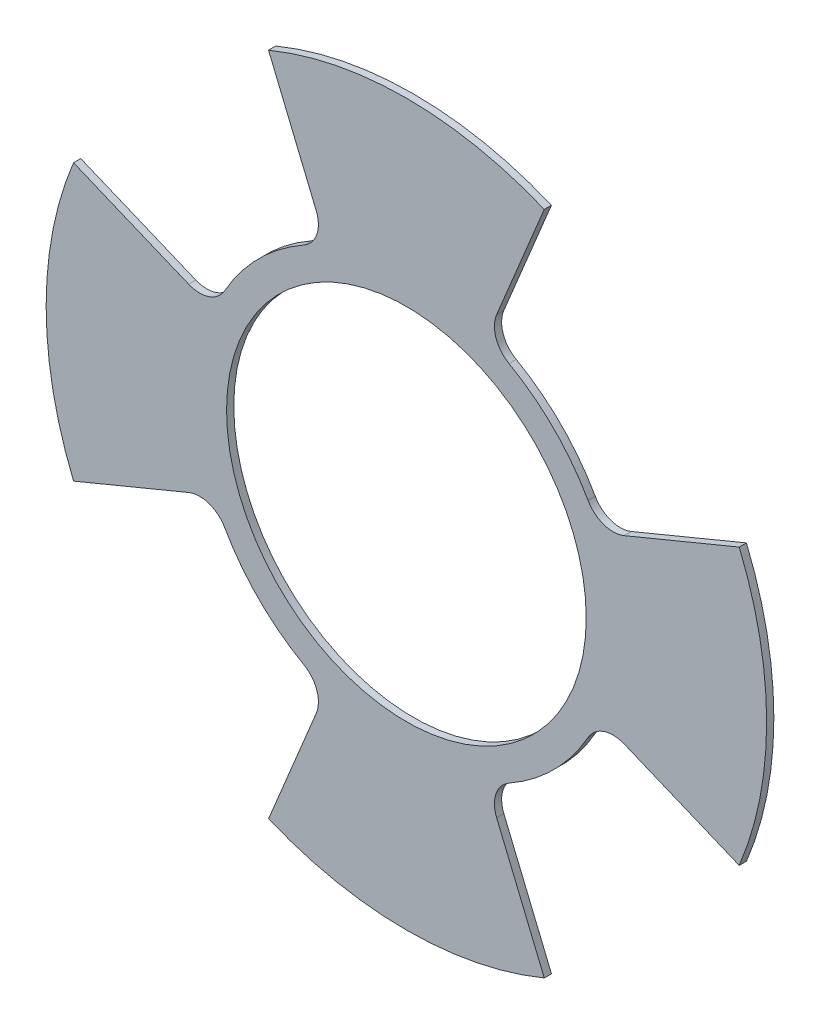
ISO-10303-21;
HEADER;
FILE_DESCRIPTION(('STEP AP214'),'2;1');
FILE_NAME('part.step','',(''),(''),'','','');
FILE_SCHEMA(('AUTOMOTIVE_DESIGN { 1 0 10303 214 1 1 1 1 }'));
ENDSEC;
DATA;
#1=APPLICATION_CONTEXT('core data for automotive mechanical design processes');
#2=APPLICATION_PROTOCOL_DEFINITION('international standard','automotive_design',2000,#1);
#3=PRODUCT_CONTEXT('',#1,'mechanical');
#4=PRODUCT('Part','Part','',(#3));
#5=PRODUCT_RELATED_PRODUCT_CATEGORY('part','',(#4));
#6=PRODUCT_DEFINITION_FORMATION('','',#4);
#7=PRODUCT_DEFINITION_CONTEXT('part definition',#1,'design');
#8=PRODUCT_DEFINITION('design','',#6,#7);
#9=PRODUCT_DEFINITION_SHAPE('','',#8);
#10=(LENGTH_UNIT() NAMED_UNIT(*) SI_UNIT(.MILLI.,.METRE.));
#11=(NAMED_UNIT(*) PLANE_ANGLE_UNIT() SI_UNIT($,.RADIAN.));
#12=(NAMED_UNIT(*) SI_UNIT($,.STERADIAN.) SOLID_ANGLE_UNIT());
#13=UNCERTAINTY_MEASURE_WITH_UNIT(LENGTH_MEASURE(1.E-05),#10,'distance_accuracy_value','');
#14=(GEOMETRIC_REPRESENTATION_CONTEXT(3) GLOBAL_UNCERTAINTY_ASSIGNED_CONTEXT((#13)) GLOBAL_UNIT_ASSIGNED_CONTEXT((#10,
#11,#12)) REPRESENTATION_CONTEXT('',''));
#15=CARTESIAN_POINT('',(0.,0.,0.));
#16=DIRECTION('',(0.,0.,1.));
#17=DIRECTION('',(1.,0.,0.));
#18=AXIS2_PLACEMENT_3D('',#15,#16,#17);
#19=CARTESIAN_POINT('',(0.,0.,0.));
#20=DIRECTION('',(0.,0.,1.));
#21=DIRECTION('',(1.,0.,0.));
#22=AXIS2_PLACEMENT_3D('',#19,#20,#21);
#23=CYLINDRICAL_SURFACE('',#22,45.974);
#24=CARTESIAN_POINT('',(0.,0.,0.));
#25=DIRECTION('',(0.,0.,1.));
#26=DIRECTION('',(1.,0.,0.));
#27=AXIS2_PLACEMENT_3D('',#24,#25,#26);
#28=CIRCLE('',#27,45.974);
#29=CARTESIAN_POINT('',(22.6181133126191,-40.0253622866492,0.));
#30=VERTEX_POINT('',#29);
#31=CARTESIAN_POINT('',(40.0253622866495,-22.6181133126187,0.));
#32=VERTEX_POINT('',#31);
#33=EDGE_CURVE('E761',#30,#32,#28,.T.);
#34=ORIENTED_EDGE('',*,*,#33,.T.);
#35=DIRECTION('',(0.,0.,1.));
#36=VECTOR('',#35,1.);
#37=CARTESIAN_POINT('',(40.0253622866495,-22.6181133126187,0.));
#38=LINE('',#37,#36);
#39=CARTESIAN_POINT('',(40.0253622866495,-22.6181133126187,1.5875));
#40=VERTEX_POINT('',#39);
#41=EDGE_CURVE('E360',#32,#40,#38,.T.);
#42=ORIENTED_EDGE('',*,*,#41,.T.);
#43=CARTESIAN_POINT('',(0.,0.,1.5875));
#44=DIRECTION('',(0.,0.,1.));
#45=DIRECTION('',(1.,0.,0.));
#46=AXIS2_PLACEMENT_3D('',#43,#44,#45);
#47=CIRCLE('',#46,45.974);
#48=CARTESIAN_POINT('',(22.6181133126191,-40.0253622866492,1.5875));
#49=VERTEX_POINT('',#48);
#50=EDGE_CURVE('E385',#49,#40,#47,.T.);
#51=ORIENTED_EDGE('',*,*,#50,.F.);
#52=DIRECTION('',(0.,0.,1.));
#53=VECTOR('',#52,1.);
#54=CARTESIAN_POINT('',(22.6181133126191,-40.0253622866492,0.));
#55=LINE('',#54,#53);
#56=EDGE_CURVE('E340',#49,#30,#55,.F.);
#57=ORIENTED_EDGE('',*,*,#56,.T.);
#58=EDGE_LOOP('',(#34,#42,#51,#57));
#59=FACE_BOUND('',#58,.T.);
#60=ADVANCED_FACE('F39',(#59),#23,.T.);
#61=CARTESIAN_POINT('',(-40.0253622866491,-22.6181133126192,0.));
#62=VERTEX_POINT('',#61);
#63=CARTESIAN_POINT('',(-22.6181133126191,-40.0253622866492,0.));
#64=VERTEX_POINT('',#63);
#65=EDGE_CURVE('E289',#62,#64,#28,.T.);
#66=ORIENTED_EDGE('',*,*,#65,.T.);
#67=DIRECTION('',(0.,0.,1.));
#68=VECTOR('',#67,1.);
#69=CARTESIAN_POINT('',(-22.6181133126191,-40.0253622866492,0.));
#70=LINE('',#69,#68);
#71=CARTESIAN_POINT('',(-22.6181133126191,-40.0253622866492,1.5875));
#72=VERTEX_POINT('',#71);
#73=EDGE_CURVE('E342',#64,#72,#70,.T.);
#74=ORIENTED_EDGE('',*,*,#73,.T.);
#75=CARTESIAN_POINT('',(-40.0253622866491,-22.6181133126192,1.5875));
#76=VERTEX_POINT('',#75);
#77=EDGE_CURVE('E294',#76,#72,#47,.T.);
#78=ORIENTED_EDGE('',*,*,#77,.F.);
#79=DIRECTION('',(0.,0.,1.));
#80=VECTOR('',#79,1.);
#81=CARTESIAN_POINT('',(-40.0253622866492,-22.6181133126192,0.));
#82=LINE('',#81,#80);
#83=EDGE_CURVE('E322',#76,#62,#82,.F.);
#84=ORIENTED_EDGE('',*,*,#83,.T.);
#85=EDGE_LOOP('',(#66,#74,#78,#84));
#86=FACE_BOUND('',#85,.T.);
#87=ADVANCED_FACE('F393',(#86),#23,.T.);
#88=CARTESIAN_POINT('',(-22.6181133126191,40.0253622866492,0.));
#89=VERTEX_POINT('',#88);
#90=CARTESIAN_POINT('',(-40.0253622866493,22.618113312619,0.));
#91=VERTEX_POINT('',#90);
#92=EDGE_CURVE('E285',#89,#91,#28,.T.);
#93=ORIENTED_EDGE('',*,*,#92,.T.);
#94=DIRECTION('',(0.,0.,1.));
#95=VECTOR('',#94,1.);
#96=CARTESIAN_POINT('',(-40.0253622866493,22.618113312619,0.));
#97=LINE('',#96,#95);
#98=CARTESIAN_POINT('',(-40.0253622866493,22.618113312619,1.5875));
#99=VERTEX_POINT('',#98);
#100=EDGE_CURVE('E324',#91,#99,#97,.T.);
#101=ORIENTED_EDGE('',*,*,#100,.T.);
#102=CARTESIAN_POINT('',(-22.6181133126191,40.0253622866492,1.5875));
#103=VERTEX_POINT('',#102);
#104=EDGE_CURVE('E291',#103,#99,#47,.T.);
#105=ORIENTED_EDGE('',*,*,#104,.F.);
#106=DIRECTION('',(0.,0.,1.));
#107=VECTOR('',#106,1.);
#108=CARTESIAN_POINT('',(-22.6181133126191,40.0253622866492,0.));
#109=LINE('',#108,#107);
#110=EDGE_CURVE('E306',#103,#89,#109,.F.);
#111=ORIENTED_EDGE('',*,*,#110,.T.);
#112=EDGE_LOOP('',(#93,#101,#105,#111));
#113=FACE_BOUND('',#112,.T.);
#114=ADVANCED_FACE('F419',(#113),#23,.T.);
#115=CARTESIAN_POINT('',(40.025362286649,22.6181133126195,1.5875));
#116=VERTEX_POINT('',#115);
#117=CARTESIAN_POINT('',(22.6181133126191,40.0253622866492,1.5875));
#118=VERTEX_POINT('',#117);
#119=EDGE_CURVE('E284',#116,#118,#47,.T.);
#120=ORIENTED_EDGE('',*,*,#119,.F.);
#121=DIRECTION('',(0.,0.,1.));
#122=VECTOR('',#121,1.);
#123=CARTESIAN_POINT('',(40.025362286649,22.6181133126195,0.));
#124=LINE('',#123,#122);
#125=CARTESIAN_POINT('',(40.025362286649,22.6181133126195,0.));
#126=VERTEX_POINT('',#125);
#127=EDGE_CURVE('E358',#116,#126,#124,.F.);
#128=ORIENTED_EDGE('',*,*,#127,.T.);
#129=CARTESIAN_POINT('',(22.6181133126191,40.0253622866492,0.));
#130=VERTEX_POINT('',#129);
#131=EDGE_CURVE('E290',#126,#130,#28,.T.);
#132=ORIENTED_EDGE('',*,*,#131,.T.);
#133=DIRECTION('',(0.,0.,1.));
#134=VECTOR('',#133,1.);
#135=CARTESIAN_POINT('',(22.6181133126191,40.0253622866492,0.));
#136=LINE('',#135,#134);
#137=EDGE_CURVE('E303',#130,#118,#136,.T.);
#138=ORIENTED_EDGE('',*,*,#137,.T.);
#139=EDGE_LOOP('',(#120,#128,#132,#138));
#140=FACE_BOUND('',#139,.T.);
#141=ADVANCED_FACE('F383',(#140),#23,.T.);
#142=CARTESIAN_POINT('',(0.,0.,1.5875));
#143=DIRECTION('',(0.,0.,1.));
#144=DIRECTION('',(1.,0.,0.));
#145=AXIS2_PLACEMENT_3D('',#142,#143,#144);
#146=PLANE('',#145);
#147=CARTESIAN_POINT('',(0.,0.,1.5875));
#148=DIRECTION('',(0.,0.,1.));
#149=DIRECTION('',(1.,0.,0.));
#150=AXIS2_PLACEMENT_3D('',#147,#148,#149);
#151=CIRCLE('',#150,39.624);
#152=CARTESIAN_POINT('',(39.624,0.,1.5875));
#153=VERTEX_POINT('',#152);
#154=EDGE_CURVE('E295',#153,#153,#151,.T.);
#155=ORIENTED_EDGE('',*,*,#154,.F.);
#156=EDGE_LOOP('',(#155));
#157=FACE_BOUND('',#156,.T.);
#158=DIRECTION('',(0.382683432365087,-0.923879532511288,0.));
#159=VECTOR('',#158,1.);
#160=CARTESIAN_POINT('',(0.,0.,1.5875));
#161=LINE('',#160,#159);
#162=CARTESIAN_POINT('',(-30.3754974439788,73.3329378930835,1.5875));
#163=VERTEX_POINT('',#162);
#164=CARTESIAN_POINT('',(-19.8755270812579,47.983767038887,1.5875));
#165=VERTEX_POINT('',#164);
#166=EDGE_CURVE('E277',#163,#165,#161,.T.);
#167=ORIENTED_EDGE('',*,*,#166,.T.);
#168=CARTESIAN_POINT('',(-25.7421621127046,45.5537272433687,1.5875));
#169=DIRECTION('',(0.,0.,1.));
#170=DIRECTION('',(1.,0.,0.));
#171=AXIS2_PLACEMENT_3D('',#168,#169,#170);
#172=CIRCLE('',#171,6.35);
#173=EDGE_CURVE('E310',#165,#103,#172,.F.);
#174=ORIENTED_EDGE('',*,*,#173,.T.);
#175=ORIENTED_EDGE('',*,*,#104,.T.);
#176=CARTESIAN_POINT('',(-45.5537272433688,25.7421621127045,1.5875));
#177=DIRECTION('',(0.,0.,1.));
#178=DIRECTION('',(1.,0.,0.));
#179=AXIS2_PLACEMENT_3D('',#176,#177,#178);
#180=CIRCLE('',#179,6.35);
#181=CARTESIAN_POINT('',(-47.9837670388871,19.8755270812578,1.5875));
#182=VERTEX_POINT('',#181);
#183=EDGE_CURVE('E333',#99,#182,#180,.F.);
#184=ORIENTED_EDGE('',*,*,#183,.T.);
#185=DIRECTION('',(0.923879532511289,-0.382683432365084,0.));
#186=VECTOR('',#185,1.);
#187=CARTESIAN_POINT('',(0.,0.,1.5875));
#188=LINE('',#187,#186);
#189=CARTESIAN_POINT('',(-73.3329378930836,30.3754974439785,1.5875));
#190=VERTEX_POINT('',#189);
#191=EDGE_CURVE('E245',#190,#182,#188,.T.);
#192=ORIENTED_EDGE('',*,*,#191,.F.);
#193=CARTESIAN_POINT('',(0.,0.,1.5875));
#194=DIRECTION('',(0.,0.,1.));
#195=DIRECTION('',(0.,1.,0.));
#196=AXIS2_PLACEMENT_3D('',#193,#194,#195);
#197=CIRCLE('',#196,79.375);
#198=CARTESIAN_POINT('',(-73.3329378930834,-30.3754974439791,1.5875));
#199=VERTEX_POINT('',#198);
#200=EDGE_CURVE('E254',#190,#199,#197,.T.);
#201=ORIENTED_EDGE('',*,*,#200,.T.);
#202=DIRECTION('',(0.923879532511287,0.38268343236509,0.));
#203=VECTOR('',#202,1.);
#204=CARTESIAN_POINT('',(0.,0.,1.5875));
#205=LINE('',#204,#203);
#206=CARTESIAN_POINT('',(-47.983767038887,-19.8755270812581,1.5875));
#207=VERTEX_POINT('',#206);
#208=EDGE_CURVE('E257',#199,#207,#205,.T.);
#209=ORIENTED_EDGE('',*,*,#208,.T.);
#210=CARTESIAN_POINT('',(-45.5537272433686,-25.7421621127048,1.5875));
#211=DIRECTION('',(0.,0.,1.));
#212=DIRECTION('',(1.,0.,0.));
#213=AXIS2_PLACEMENT_3D('',#210,#211,#212);
#214=CIRCLE('',#213,6.35);
#215=EDGE_CURVE('E329',#207,#76,#214,.F.);
#216=ORIENTED_EDGE('',*,*,#215,.T.);
#217=ORIENTED_EDGE('',*,*,#77,.T.);
#218=CARTESIAN_POINT('',(-25.7421621127046,-45.5537272433687,1.5875));
#219=DIRECTION('',(0.,0.,1.));
#220=DIRECTION('',(1.,0.,0.));
#221=AXIS2_PLACEMENT_3D('',#218,#219,#220);
#222=CIRCLE('',#221,6.35);
#223=CARTESIAN_POINT('',(-19.8755270812579,-47.983767038887,1.5875));
#224=VERTEX_POINT('',#223);
#225=EDGE_CURVE('E351',#72,#224,#222,.F.);
#226=ORIENTED_EDGE('',*,*,#225,.T.);
#227=DIRECTION('',(0.382683432365087,0.923879532511288,0.));
#228=VECTOR('',#227,1.);
#229=CARTESIAN_POINT('',(0.,0.,1.5875));
#230=LINE('',#229,#228);
#231=CARTESIAN_POINT('',(-30.3754974439788,-73.3329378930835,1.5875));
#232=VERTEX_POINT('',#231);
#233=EDGE_CURVE('E225',#232,#224,#230,.T.);
#234=ORIENTED_EDGE('',*,*,#233,.F.);
#235=CARTESIAN_POINT('',(0.,0.,1.5875));
#236=DIRECTION('',(0.,0.,1.));
#237=DIRECTION('',(-1.,0.,0.));
#238=AXIS2_PLACEMENT_3D('',#235,#236,#237);
#239=CIRCLE('',#238,79.375);
#240=CARTESIAN_POINT('',(30.3754974439788,-73.3329378930835,1.5875));
#241=VERTEX_POINT('',#240);
#242=EDGE_CURVE('E234',#232,#241,#239,.T.);
#243=ORIENTED_EDGE('',*,*,#242,.T.);
#244=DIRECTION('',(-0.382683432365087,0.923879532511288,0.));
#245=VECTOR('',#244,1.);
#246=CARTESIAN_POINT('',(0.,0.,1.5875));
#247=LINE('',#246,#245);
#248=CARTESIAN_POINT('',(19.8755270812579,-47.983767038887,1.5875));
#249=VERTEX_POINT('',#248);
#250=EDGE_CURVE('E237',#241,#249,#247,.T.);
#251=ORIENTED_EDGE('',*,*,#250,.T.);
#252=CARTESIAN_POINT('',(25.7421621127046,-45.5537272433687,1.5875));
#253=DIRECTION('',(0.,0.,1.));
#254=DIRECTION('',(1.,0.,0.));
#255=AXIS2_PLACEMENT_3D('',#252,#253,#254);
#256=CIRCLE('',#255,6.35);
#257=EDGE_CURVE('E347',#249,#49,#256,.F.);
#258=ORIENTED_EDGE('',*,*,#257,.T.);
#259=ORIENTED_EDGE('',*,*,#50,.T.);
#260=CARTESIAN_POINT('',(45.553727243369,-25.7421621127041,1.5875));
#261=DIRECTION('',(0.,0.,1.));
#262=DIRECTION('',(1.,0.,0.));
#263=AXIS2_PLACEMENT_3D('',#260,#261,#262);
#264=CIRCLE('',#263,6.35);
#265=CARTESIAN_POINT('',(47.9837670388873,-19.8755270812575,1.5875));
#266=VERTEX_POINT('',#265);
#267=EDGE_CURVE('E47',#40,#266,#264,.F.);
#268=ORIENTED_EDGE('',*,*,#267,.T.);
#269=DIRECTION('',(-0.923879532511292,0.382683432365077,0.));
#270=VECTOR('',#269,1.);
#271=CARTESIAN_POINT('',(0.,0.,1.5875));
#272=LINE('',#271,#270);
#273=CARTESIAN_POINT('',(73.3329378930838,-30.375497443978,1.5875));
#274=VERTEX_POINT('',#273);
#275=EDGE_CURVE('E199',#274,#266,#272,.T.);
#276=ORIENTED_EDGE('',*,*,#275,.F.);
#277=CARTESIAN_POINT('',(0.,0.,1.5875));
#278=DIRECTION('',(0.,0.,1.));
#279=DIRECTION('',(0.,-1.,0.));
#280=AXIS2_PLACEMENT_3D('',#277,#278,#279);
#281=CIRCLE('',#280,79.375);
#282=CARTESIAN_POINT('',(73.3329378930832,30.3754974439796,1.5875));
#283=VERTEX_POINT('',#282);
#284=EDGE_CURVE('E212',#274,#283,#281,.T.);
#285=ORIENTED_EDGE('',*,*,#284,.T.);
#286=DIRECTION('',(-0.923879532511284,-0.382683432365097,0.));
#287=VECTOR('',#286,1.);
#288=CARTESIAN_POINT('',(0.,0.,1.5875));
#289=LINE('',#288,#287);
#290=CARTESIAN_POINT('',(47.9837670388868,19.8755270812585,1.5875));
#291=VERTEX_POINT('',#290);
#292=EDGE_CURVE('E206',#283,#291,#289,.T.);
#293=ORIENTED_EDGE('',*,*,#292,.T.);
#294=CARTESIAN_POINT('',(45.5537272433685,25.7421621127051,1.5875));
#295=DIRECTION('',(0.,0.,1.));
#296=DIRECTION('',(1.,0.,0.));
#297=AXIS2_PLACEMENT_3D('',#294,#295,#296);
#298=CIRCLE('',#297,6.35);
#299=EDGE_CURVE('E364',#291,#116,#298,.F.);
#300=ORIENTED_EDGE('',*,*,#299,.T.);
#301=ORIENTED_EDGE('',*,*,#119,.T.);
#302=CARTESIAN_POINT('',(25.7421621127046,45.5537272433687,1.5875));
#303=DIRECTION('',(0.,0.,1.));
#304=DIRECTION('',(1.,0.,0.));
#305=AXIS2_PLACEMENT_3D('',#302,#303,#304);
#306=CIRCLE('',#305,6.35);
#307=CARTESIAN_POINT('',(19.8755270812579,47.983767038887,1.5875));
#308=VERTEX_POINT('',#307);
#309=EDGE_CURVE('E314',#118,#308,#306,.F.);
#310=ORIENTED_EDGE('',*,*,#309,.T.);
#311=DIRECTION('',(-0.382683432365087,-0.923879532511288,0.));
#312=VECTOR('',#311,1.);
#313=CARTESIAN_POINT('',(0.,0.,1.5875));
#314=LINE('',#313,#312);
#315=CARTESIAN_POINT('',(30.3754974439788,73.3329378930835,1.5875));
#316=VERTEX_POINT('',#315);
#317=EDGE_CURVE('E265',#316,#308,#314,.T.);
#318=ORIENTED_EDGE('',*,*,#317,.F.);
#319=CARTESIAN_POINT('',(0.,0.,1.5875));
#320=DIRECTION('',(0.,0.,1.));
#321=DIRECTION('',(1.,0.,0.));
#322=AXIS2_PLACEMENT_3D('',#319,#320,#321);
#323=CIRCLE('',#322,79.375);
#324=EDGE_CURVE('E274',#316,#163,#323,.T.);
#325=ORIENTED_EDGE('',*,*,#324,.T.);
#326=EDGE_LOOP('',(#167,#174,#175,#184,#192,#201,#209,#216,#217,#226,#234,#243,#251,#258,#259,
#268,#276,#285,#293,#300,#301,#310,#318,#325));
#327=FACE_BOUND('',#326,.T.);
#328=ADVANCED_FACE('F210',(#157,#327),#146,.T.);
#329=CARTESIAN_POINT('',(0.,0.,0.));
#330=DIRECTION('',(0.,0.,1.));
#331=DIRECTION('',(1.,0.,0.));
#332=AXIS2_PLACEMENT_3D('',#329,#330,#331);
#333=PLANE('',#332);
#334=CARTESIAN_POINT('',(0.,0.,0.));
#335=DIRECTION('',(0.,0.,1.));
#336=DIRECTION('',(1.,0.,0.));
#337=AXIS2_PLACEMENT_3D('',#334,#335,#336);
#338=CIRCLE('',#337,39.624);
#339=CARTESIAN_POINT('',(39.624,0.,0.));
#340=VERTEX_POINT('',#339);
#341=EDGE_CURVE('E288',#340,#340,#338,.T.);
#342=ORIENTED_EDGE('',*,*,#341,.T.);
#343=EDGE_LOOP('',(#342));
#344=FACE_BOUND('',#343,.T.);
#345=ORIENTED_EDGE('',*,*,#92,.F.);
#346=CARTESIAN_POINT('',(-25.7421621127046,45.5537272433687,0.));
#347=DIRECTION('',(0.,0.,1.));
#348=DIRECTION('',(1.,0.,0.));
#349=AXIS2_PLACEMENT_3D('',#346,#347,#348);
#350=CIRCLE('',#349,6.35);
#351=CARTESIAN_POINT('',(-19.8755270812579,47.983767038887,0.));
#352=VERTEX_POINT('',#351);
#353=EDGE_CURVE('E312',#89,#352,#350,.T.);
#354=ORIENTED_EDGE('',*,*,#353,.T.);
#355=DIRECTION('',(-0.382683432365087,0.923879532511288,0.));
#356=VECTOR('',#355,1.);
#357=CARTESIAN_POINT('',(0.,0.,0.));
#358=LINE('',#357,#356);
#359=CARTESIAN_POINT('',(-30.3754974439788,73.3329378930835,0.));
#360=VERTEX_POINT('',#359);
#361=EDGE_CURVE('E266',#352,#360,#358,.T.);
#362=ORIENTED_EDGE('',*,*,#361,.T.);
#363=CARTESIAN_POINT('',(0.,0.,0.));
#364=DIRECTION('',(0.,0.,1.));
#365=DIRECTION('',(1.,0.,0.));
#366=AXIS2_PLACEMENT_3D('',#363,#364,#365);
#367=CIRCLE('',#366,79.375);
#368=CARTESIAN_POINT('',(30.3754974439788,73.3329378930835,0.));
#369=VERTEX_POINT('',#368);
#370=EDGE_CURVE('E271',#360,#369,#367,.F.);
#371=ORIENTED_EDGE('',*,*,#370,.T.);
#372=DIRECTION('',(0.382683432365087,0.923879532511288,0.));
#373=VECTOR('',#372,1.);
#374=CARTESIAN_POINT('',(0.,0.,0.));
#375=LINE('',#374,#373);
#376=CARTESIAN_POINT('',(19.8755270812579,47.983767038887,0.));
#377=VERTEX_POINT('',#376);
#378=EDGE_CURVE('E268',#377,#369,#375,.T.);
#379=ORIENTED_EDGE('',*,*,#378,.F.);
#380=CARTESIAN_POINT('',(25.7421621127046,45.5537272433687,0.));
#381=DIRECTION('',(0.,0.,1.));
#382=DIRECTION('',(1.,0.,0.));
#383=AXIS2_PLACEMENT_3D('',#380,#381,#382);
#384=CIRCLE('',#383,6.35);
#385=EDGE_CURVE('E316',#377,#130,#384,.T.);
#386=ORIENTED_EDGE('',*,*,#385,.T.);
#387=ORIENTED_EDGE('',*,*,#131,.F.);
#388=CARTESIAN_POINT('',(45.5537272433685,25.7421621127051,0.));
#389=DIRECTION('',(0.,0.,1.));
#390=DIRECTION('',(1.,0.,0.));
#391=AXIS2_PLACEMENT_3D('',#388,#389,#390);
#392=CIRCLE('',#391,6.35);
#393=CARTESIAN_POINT('',(47.9837670388868,19.8755270812585,0.));
#394=VERTEX_POINT('',#393);
#395=EDGE_CURVE('E366',#126,#394,#392,.T.);
#396=ORIENTED_EDGE('',*,*,#395,.T.);
#397=DIRECTION('',(0.923879532511284,0.382683432365097,0.));
#398=VECTOR('',#397,1.);
#399=CARTESIAN_POINT('',(0.,0.,0.));
#400=LINE('',#399,#398);
#401=CARTESIAN_POINT('',(73.3329378930832,30.3754974439796,0.));
#402=VERTEX_POINT('',#401);
#403=EDGE_CURVE('E221',#394,#402,#400,.T.);
#404=ORIENTED_EDGE('',*,*,#403,.T.);
#405=CARTESIAN_POINT('',(0.,0.,0.));
#406=DIRECTION('',(0.,0.,1.));
#407=DIRECTION('',(1.,0.,0.));
#408=AXIS2_PLACEMENT_3D('',#405,#406,#407);
#409=CIRCLE('',#408,79.375);
#410=CARTESIAN_POINT('',(73.3329378930838,-30.375497443978,0.));
#411=VERTEX_POINT('',#410);
#412=EDGE_CURVE('E223',#402,#411,#409,.F.);
#413=ORIENTED_EDGE('',*,*,#412,.T.);
#414=DIRECTION('',(0.923879532511292,-0.382683432365077,0.));
#415=VECTOR('',#414,1.);
#416=CARTESIAN_POINT('',(0.,0.,0.));
#417=LINE('',#416,#415);
#418=CARTESIAN_POINT('',(47.9837670388873,-19.8755270812574,0.));
#419=VERTEX_POINT('',#418);
#420=EDGE_CURVE('E200',#419,#411,#417,.T.);
#421=ORIENTED_EDGE('',*,*,#420,.F.);
#422=CARTESIAN_POINT('',(45.553727243369,-25.7421621127041,0.));
#423=DIRECTION('',(0.,0.,1.));
#424=DIRECTION('',(1.,0.,0.));
#425=AXIS2_PLACEMENT_3D('',#422,#423,#424);
#426=CIRCLE('',#425,6.35);
#427=EDGE_CURVE('E11',#419,#32,#426,.T.);
#428=ORIENTED_EDGE('',*,*,#427,.T.);
#429=ORIENTED_EDGE('',*,*,#33,.F.);
#430=CARTESIAN_POINT('',(25.7421621127046,-45.5537272433687,0.));
#431=DIRECTION('',(0.,0.,1.));
#432=DIRECTION('',(1.,0.,0.));
#433=AXIS2_PLACEMENT_3D('',#430,#431,#432);
#434=CIRCLE('',#433,6.35);
#435=CARTESIAN_POINT('',(19.8755270812579,-47.983767038887,0.));
#436=VERTEX_POINT('',#435);
#437=EDGE_CURVE('E349',#30,#436,#434,.T.);
#438=ORIENTED_EDGE('',*,*,#437,.T.);
#439=DIRECTION('',(0.382683432365087,-0.923879532511288,0.));
#440=VECTOR('',#439,1.);
#441=CARTESIAN_POINT('',(0.,0.,0.));
#442=LINE('',#441,#440);
#443=CARTESIAN_POINT('',(30.3754974439788,-73.3329378930835,0.));
#444=VERTEX_POINT('',#443);
#445=EDGE_CURVE('E226',#436,#444,#442,.T.);
#446=ORIENTED_EDGE('',*,*,#445,.T.);
#447=CARTESIAN_POINT('',(0.,0.,0.));
#448=DIRECTION('',(0.,0.,1.));
#449=DIRECTION('',(1.,0.,0.));
#450=AXIS2_PLACEMENT_3D('',#447,#448,#449);
#451=CIRCLE('',#450,79.375);
#452=CARTESIAN_POINT('',(-30.3754974439788,-73.3329378930835,0.));
#453=VERTEX_POINT('',#452);
#454=EDGE_CURVE('E231',#444,#453,#451,.F.);
#455=ORIENTED_EDGE('',*,*,#454,.T.);
#456=DIRECTION('',(-0.382683432365087,-0.923879532511288,0.));
#457=VECTOR('',#456,1.);
#458=CARTESIAN_POINT('',(0.,0.,0.));
#459=LINE('',#458,#457);
#460=CARTESIAN_POINT('',(-19.8755270812579,-47.983767038887,0.));
#461=VERTEX_POINT('',#460);
#462=EDGE_CURVE('E228',#461,#453,#459,.T.);
#463=ORIENTED_EDGE('',*,*,#462,.F.);
#464=CARTESIAN_POINT('',(-25.7421621127046,-45.5537272433687,0.));
#465=DIRECTION('',(0.,0.,1.));
#466=DIRECTION('',(1.,0.,0.));
#467=AXIS2_PLACEMENT_3D('',#464,#465,#466);
#468=CIRCLE('',#467,6.35);
#469=EDGE_CURVE('E353',#461,#64,#468,.T.);
#470=ORIENTED_EDGE('',*,*,#469,.T.);
#471=ORIENTED_EDGE('',*,*,#65,.F.);
#472=CARTESIAN_POINT('',(-45.5537272433686,-25.7421621127048,0.));
#473=DIRECTION('',(0.,0.,1.));
#474=DIRECTION('',(1.,0.,0.));
#475=AXIS2_PLACEMENT_3D('',#472,#473,#474);
#476=CIRCLE('',#475,6.35);
#477=CARTESIAN_POINT('',(-47.983767038887,-19.8755270812581,0.));
#478=VERTEX_POINT('',#477);
#479=EDGE_CURVE('E331',#62,#478,#476,.T.);
#480=ORIENTED_EDGE('',*,*,#479,.T.);
#481=DIRECTION('',(-0.923879532511287,-0.38268343236509,0.));
#482=VECTOR('',#481,1.);
#483=CARTESIAN_POINT('',(0.,0.,0.));
#484=LINE('',#483,#482);
#485=CARTESIAN_POINT('',(-73.3329378930834,-30.3754974439791,0.));
#486=VERTEX_POINT('',#485);
#487=EDGE_CURVE('E246',#478,#486,#484,.T.);
#488=ORIENTED_EDGE('',*,*,#487,.T.);
#489=CARTESIAN_POINT('',(0.,0.,0.));
#490=DIRECTION('',(0.,0.,1.));
#491=DIRECTION('',(1.,0.,0.));
#492=AXIS2_PLACEMENT_3D('',#489,#490,#491);
#493=CIRCLE('',#492,79.375);
#494=CARTESIAN_POINT('',(-73.3329378930836,30.3754974439785,0.));
#495=VERTEX_POINT('',#494);
#496=EDGE_CURVE('E251',#486,#495,#493,.F.);
#497=ORIENTED_EDGE('',*,*,#496,.T.);
#498=DIRECTION('',(-0.923879532511289,0.382683432365084,0.));
#499=VECTOR('',#498,1.);
#500=CARTESIAN_POINT('',(0.,0.,0.));
#501=LINE('',#500,#499);
#502=CARTESIAN_POINT('',(-47.9837670388871,19.8755270812578,0.));
#503=VERTEX_POINT('',#502);
#504=EDGE_CURVE('E248',#503,#495,#501,.T.);
#505=ORIENTED_EDGE('',*,*,#504,.F.);
#506=CARTESIAN_POINT('',(-45.5537272433688,25.7421621127045,0.));
#507=DIRECTION('',(0.,0.,1.));
#508=DIRECTION('',(1.,0.,0.));
#509=AXIS2_PLACEMENT_3D('',#506,#507,#508);
#510=CIRCLE('',#509,6.35);
#511=EDGE_CURVE('E335',#503,#91,#510,.T.);
#512=ORIENTED_EDGE('',*,*,#511,.T.);
#513=EDGE_LOOP('',(#345,#354,#362,#371,#379,#386,#387,#396,#404,#413,#421,#428,#429,#438,#446,
#455,#463,#470,#471,#480,#488,#497,#505,#512));
#514=FACE_BOUND('',#513,.T.);
#515=ADVANCED_FACE('F372',(#344,#514),#333,.F.);
#516=CARTESIAN_POINT('',(0.,0.,1.5875));
#517=DIRECTION('',(0.,0.,-1.));
#518=DIRECTION('',(-1.,0.,0.));
#519=AXIS2_PLACEMENT_3D('',#516,#517,#518);
#520=CYLINDRICAL_SURFACE('',#519,39.624);
#521=ORIENTED_EDGE('',*,*,#154,.T.);
#522=EDGE_LOOP('',(#521));
#523=FACE_BOUND('',#522,.T.);
#524=ORIENTED_EDGE('',*,*,#341,.F.);
#525=EDGE_LOOP('',(#524));
#526=FACE_BOUND('',#525,.T.);
#527=ADVANCED_FACE('F514',(#523,#526),#520,.F.);
#528=CARTESIAN_POINT('',(0.,0.,-71.0797783006572));
#529=DIRECTION('',(-0.923879532511288,0.382683432365087,0.));
#530=DIRECTION('',(-0.382683432365087,-0.923879532511288,0.));
#531=AXIS2_PLACEMENT_3D('',#528,#529,#530);
#532=PLANE('',#531);
#533=ORIENTED_EDGE('',*,*,#317,.T.);
#534=DIRECTION('',(0.,0.,1.));
#535=VECTOR('',#534,1.);
#536=CARTESIAN_POINT('',(19.8755270812579,47.983767038887,-71.0797783006572));
#537=LINE('',#536,#535);
#538=EDGE_CURVE('E308',#308,#377,#537,.F.);
#539=ORIENTED_EDGE('',*,*,#538,.T.);
#540=ORIENTED_EDGE('',*,*,#378,.T.);
#541=DIRECTION('',(0.,0.,1.));
#542=VECTOR('',#541,1.);
#543=CARTESIAN_POINT('',(30.3754974439788,73.3329378930835,-71.0797783006572));
#544=LINE('',#543,#542);
#545=EDGE_CURVE('E279',#369,#316,#544,.T.);
#546=ORIENTED_EDGE('',*,*,#545,.T.);
#547=EDGE_LOOP('',(#533,#539,#540,#546));
#548=FACE_BOUND('',#547,.T.);
#549=ADVANCED_FACE('F440',(#548),#532,.F.);
#550=CARTESIAN_POINT('',(0.,0.,-71.0797783006572));
#551=DIRECTION('',(-0.923879532511288,-0.382683432365087,0.));
#552=DIRECTION('',(0.382683432365087,-0.923879532511288,0.));
#553=AXIS2_PLACEMENT_3D('',#550,#551,#552);
#554=PLANE('',#553);
#555=ORIENTED_EDGE('',*,*,#361,.F.);
#556=DIRECTION('',(0.,0.,-1.));
#557=VECTOR('',#556,1.);
#558=CARTESIAN_POINT('',(-19.8755270812579,47.983767038887,1.5875));
#559=LINE('',#558,#557);
#560=EDGE_CURVE('E298',#352,#165,#559,.F.);
#561=ORIENTED_EDGE('',*,*,#560,.T.);
#562=ORIENTED_EDGE('',*,*,#166,.F.);
#563=DIRECTION('',(0.,0.,1.));
#564=VECTOR('',#563,1.);
#565=CARTESIAN_POINT('',(-30.3754974439788,73.3329378930835,-71.0797783006572));
#566=LINE('',#565,#564);
#567=EDGE_CURVE('E269',#360,#163,#566,.T.);
#568=ORIENTED_EDGE('',*,*,#567,.F.);
#569=EDGE_LOOP('',(#555,#561,#562,#568));
#570=FACE_BOUND('',#569,.T.);
#571=ADVANCED_FACE('F429',(#570),#554,.T.);
#572=CARTESIAN_POINT('',(0.,0.,-71.0797783006572));
#573=DIRECTION('',(0.,0.,1.));
#574=DIRECTION('',(1.,0.,0.));
#575=AXIS2_PLACEMENT_3D('',#572,#573,#574);
#576=CYLINDRICAL_SURFACE('',#575,79.375);
#577=ORIENTED_EDGE('',*,*,#370,.F.);
#578=ORIENTED_EDGE('',*,*,#567,.T.);
#579=ORIENTED_EDGE('',*,*,#324,.F.);
#580=ORIENTED_EDGE('',*,*,#545,.F.);
#581=EDGE_LOOP('',(#577,#578,#579,#580));
#582=FACE_BOUND('',#581,.T.);
#583=ADVANCED_FACE('F437',(#582),#576,.T.);
#584=CARTESIAN_POINT('',(-25.7421621127046,45.5537272433687,0.));
#585=DIRECTION('',(0.,0.,1.));
#586=DIRECTION('',(1.,0.,0.));
#587=AXIS2_PLACEMENT_3D('',#584,#585,#586);
#588=CYLINDRICAL_SURFACE('',#587,6.35);
#589=ORIENTED_EDGE('',*,*,#353,.F.);
#590=ORIENTED_EDGE('',*,*,#110,.F.);
#591=ORIENTED_EDGE('',*,*,#173,.F.);
#592=ORIENTED_EDGE('',*,*,#560,.F.);
#593=EDGE_LOOP('',(#589,#590,#591,#592));
#594=FACE_BOUND('',#593,.T.);
#595=ADVANCED_FACE('F426',(#594),#588,.F.);
#596=CARTESIAN_POINT('',(25.7421621127046,45.5537272433687,0.));
#597=DIRECTION('',(0.,0.,1.));
#598=DIRECTION('',(1.,0.,0.));
#599=AXIS2_PLACEMENT_3D('',#596,#597,#598);
#600=CYLINDRICAL_SURFACE('',#599,6.35);
#601=ORIENTED_EDGE('',*,*,#385,.F.);
#602=ORIENTED_EDGE('',*,*,#538,.F.);
#603=ORIENTED_EDGE('',*,*,#309,.F.);
#604=ORIENTED_EDGE('',*,*,#137,.F.);
#605=EDGE_LOOP('',(#601,#602,#603,#604));
#606=FACE_BOUND('',#605,.T.);
#607=ADVANCED_FACE('F443',(#606),#600,.F.);
#608=CARTESIAN_POINT('',(0.,0.,-71.0797783006572));
#609=DIRECTION('',(-0.382683432365084,-0.923879532511289,0.));
#610=DIRECTION('',(0.923879532511289,-0.382683432365084,0.));
#611=AXIS2_PLACEMENT_3D('',#608,#609,#610);
#612=PLANE('',#611);
#613=ORIENTED_EDGE('',*,*,#191,.T.);
#614=DIRECTION('',(0.,0.,1.));
#615=VECTOR('',#614,1.);
#616=CARTESIAN_POINT('',(-47.9837670388871,19.8755270812578,-71.0797783006572));
#617=LINE('',#616,#615);
#618=EDGE_CURVE('E327',#182,#503,#617,.F.);
#619=ORIENTED_EDGE('',*,*,#618,.T.);
#620=ORIENTED_EDGE('',*,*,#504,.T.);
#621=DIRECTION('',(0.,0.,1.));
#622=VECTOR('',#621,1.);
#623=CARTESIAN_POINT('',(-73.3329378930836,30.3754974439785,-71.0797783006572));
#624=LINE('',#623,#622);
#625=EDGE_CURVE('E260',#495,#190,#624,.T.);
#626=ORIENTED_EDGE('',*,*,#625,.T.);
#627=EDGE_LOOP('',(#613,#619,#620,#626));
#628=FACE_BOUND('',#627,.T.);
#629=ADVANCED_FACE('F445',(#628),#612,.F.);
#630=CARTESIAN_POINT('',(0.,0.,-71.0797783006572));
#631=DIRECTION('',(0.38268343236509,-0.923879532511287,0.));
#632=DIRECTION('',(0.923879532511287,0.38268343236509,0.));
#633=AXIS2_PLACEMENT_3D('',#630,#631,#632);
#634=PLANE('',#633);
#635=ORIENTED_EDGE('',*,*,#487,.F.);
#636=DIRECTION('',(0.,0.,-1.));
#637=VECTOR('',#636,1.);
#638=CARTESIAN_POINT('',(-47.983767038887,-19.8755270812581,1.5875));
#639=LINE('',#638,#637);
#640=EDGE_CURVE('E319',#478,#207,#639,.F.);
#641=ORIENTED_EDGE('',*,*,#640,.T.);
#642=ORIENTED_EDGE('',*,*,#208,.F.);
#643=DIRECTION('',(0.,0.,1.));
#644=VECTOR('',#643,1.);
#645=CARTESIAN_POINT('',(-73.3329378930834,-30.3754974439791,-71.0797783006572));
#646=LINE('',#645,#644);
#647=EDGE_CURVE('E249',#486,#199,#646,.T.);
#648=ORIENTED_EDGE('',*,*,#647,.F.);
#649=EDGE_LOOP('',(#635,#641,#642,#648));
#650=FACE_BOUND('',#649,.T.);
#651=ADVANCED_FACE('F403',(#650),#634,.T.);
#652=CARTESIAN_POINT('',(0.,0.,-71.0797783006572));
#653=DIRECTION('',(0.,0.,1.));
#654=DIRECTION('',(1.,0.,0.));
#655=AXIS2_PLACEMENT_3D('',#652,#653,#654);
#656=CYLINDRICAL_SURFACE('',#655,79.375);
#657=ORIENTED_EDGE('',*,*,#496,.F.);
#658=ORIENTED_EDGE('',*,*,#647,.T.);
#659=ORIENTED_EDGE('',*,*,#200,.F.);
#660=ORIENTED_EDGE('',*,*,#625,.F.);
#661=EDGE_LOOP('',(#657,#658,#659,#660));
#662=FACE_BOUND('',#661,.T.);
#663=ADVANCED_FACE('F409',(#662),#656,.T.);
#664=CARTESIAN_POINT('',(0.,0.,-71.0797783006572));
#665=DIRECTION('',(0.923879532511288,-0.382683432365087,0.));
#666=DIRECTION('',(0.382683432365087,0.923879532511288,0.));
#667=AXIS2_PLACEMENT_3D('',#664,#665,#666);
#668=PLANE('',#667);
#669=ORIENTED_EDGE('',*,*,#233,.T.);
#670=DIRECTION('',(0.,0.,1.));
#671=VECTOR('',#670,1.);
#672=CARTESIAN_POINT('',(-19.8755270812579,-47.983767038887,-71.0797783006572));
#673=LINE('',#672,#671);
#674=EDGE_CURVE('E345',#224,#461,#673,.F.);
#675=ORIENTED_EDGE('',*,*,#674,.T.);
#676=ORIENTED_EDGE('',*,*,#462,.T.);
#677=DIRECTION('',(0.,0.,1.));
#678=VECTOR('',#677,1.);
#679=CARTESIAN_POINT('',(-30.3754974439788,-73.3329378930835,-71.0797783006572));
#680=LINE('',#679,#678);
#681=EDGE_CURVE('E240',#453,#232,#680,.T.);
#682=ORIENTED_EDGE('',*,*,#681,.T.);
#683=EDGE_LOOP('',(#669,#675,#676,#682));
#684=FACE_BOUND('',#683,.T.);
#685=ADVANCED_FACE('F625',(#684),#668,.F.);
#686=CARTESIAN_POINT('',(0.,0.,-71.0797783006572));
#687=DIRECTION('',(0.923879532511288,0.382683432365087,0.));
#688=DIRECTION('',(-0.382683432365087,0.923879532511288,0.));
#689=AXIS2_PLACEMENT_3D('',#686,#687,#688);
#690=PLANE('',#689);
#691=ORIENTED_EDGE('',*,*,#445,.F.);
#692=DIRECTION('',(0.,0.,-1.));
#693=VECTOR('',#692,1.);
#694=CARTESIAN_POINT('',(19.8755270812579,-47.983767038887,1.5875));
#695=LINE('',#694,#693);
#696=EDGE_CURVE('E337',#436,#249,#695,.F.);
#697=ORIENTED_EDGE('',*,*,#696,.T.);
#698=ORIENTED_EDGE('',*,*,#250,.F.);
#699=DIRECTION('',(0.,0.,1.));
#700=VECTOR('',#699,1.);
#701=CARTESIAN_POINT('',(30.3754974439788,-73.3329378930835,-71.0797783006572));
#702=LINE('',#701,#700);
#703=EDGE_CURVE('E229',#444,#241,#702,.T.);
#704=ORIENTED_EDGE('',*,*,#703,.F.);
#705=EDGE_LOOP('',(#691,#697,#698,#704));
#706=FACE_BOUND('',#705,.T.);
#707=ADVANCED_FACE('F635',(#706),#690,.T.);
#708=CARTESIAN_POINT('',(0.,0.,-71.0797783006572));
#709=DIRECTION('',(0.,0.,1.));
#710=DIRECTION('',(1.,0.,0.));
#711=AXIS2_PLACEMENT_3D('',#708,#709,#710);
#712=CYLINDRICAL_SURFACE('',#711,79.375);
#713=ORIENTED_EDGE('',*,*,#454,.F.);
#714=ORIENTED_EDGE('',*,*,#703,.T.);
#715=ORIENTED_EDGE('',*,*,#242,.F.);
#716=ORIENTED_EDGE('',*,*,#681,.F.);
#717=EDGE_LOOP('',(#713,#714,#715,#716));
#718=FACE_BOUND('',#717,.T.);
#719=ADVANCED_FACE('F646',(#718),#712,.T.);
#720=CARTESIAN_POINT('',(0.,0.,-71.0797783006573));
#721=DIRECTION('',(0.382683432365077,0.923879532511292,0.));
#722=DIRECTION('',(-0.923879532511292,0.382683432365077,0.));
#723=AXIS2_PLACEMENT_3D('',#720,#721,#722);
#724=PLANE('',#723);
#725=ORIENTED_EDGE('',*,*,#275,.T.);
#726=DIRECTION('',(0.,0.,1.));
#727=VECTOR('',#726,1.);
#728=CARTESIAN_POINT('',(47.9837670388873,-19.8755270812574,-71.0797783006573));
#729=LINE('',#728,#727);
#730=EDGE_CURVE('E60',#266,#419,#729,.F.);
#731=ORIENTED_EDGE('',*,*,#730,.T.);
#732=ORIENTED_EDGE('',*,*,#420,.T.);
#733=DIRECTION('',(0.,0.,1.));
#734=VECTOR('',#733,1.);
#735=CARTESIAN_POINT('',(73.3329378930838,-30.375497443978,-71.0797783006573));
#736=LINE('',#735,#734);
#737=EDGE_CURVE('E197',#411,#274,#736,.T.);
#738=ORIENTED_EDGE('',*,*,#737,.T.);
#739=EDGE_LOOP('',(#725,#731,#732,#738));
#740=FACE_BOUND('',#739,.T.);
#741=ADVANCED_FACE('F198',(#740),#724,.F.);
#742=CARTESIAN_POINT('',(0.,0.,-71.0797783006573));
#743=DIRECTION('',(-0.382683432365097,0.923879532511284,0.));
#744=DIRECTION('',(-0.923879532511284,-0.382683432365097,0.));
#745=AXIS2_PLACEMENT_3D('',#742,#743,#744);
#746=PLANE('',#745);
#747=ORIENTED_EDGE('',*,*,#403,.F.);
#748=DIRECTION('',(0.,0.,-1.));
#749=VECTOR('',#748,1.);
#750=CARTESIAN_POINT('',(47.9837670388868,19.8755270812584,1.5875));
#751=LINE('',#750,#749);
#752=EDGE_CURVE('E355',#394,#291,#751,.F.);
#753=ORIENTED_EDGE('',*,*,#752,.T.);
#754=ORIENTED_EDGE('',*,*,#292,.F.);
#755=DIRECTION('',(0.,0.,1.));
#756=VECTOR('',#755,1.);
#757=CARTESIAN_POINT('',(73.3329378930832,30.3754974439796,-71.0797783006573));
#758=LINE('',#757,#756);
#759=EDGE_CURVE('E205',#402,#283,#758,.T.);
#760=ORIENTED_EDGE('',*,*,#759,.F.);
#761=EDGE_LOOP('',(#747,#753,#754,#760));
#762=FACE_BOUND('',#761,.T.);
#763=ADVANCED_FACE('F377',(#762),#746,.T.);
#764=CARTESIAN_POINT('',(0.,0.,-71.0797783006573));
#765=DIRECTION('',(0.,0.,1.));
#766=DIRECTION('',(1.,0.,0.));
#767=AXIS2_PLACEMENT_3D('',#764,#765,#766);
#768=CYLINDRICAL_SURFACE('',#767,79.375);
#769=ORIENTED_EDGE('',*,*,#412,.F.);
#770=ORIENTED_EDGE('',*,*,#759,.T.);
#771=ORIENTED_EDGE('',*,*,#284,.F.);
#772=ORIENTED_EDGE('',*,*,#737,.F.);
#773=EDGE_LOOP('',(#769,#770,#771,#772));
#774=FACE_BOUND('',#773,.T.);
#775=ADVANCED_FACE('F214',(#774),#768,.T.);
#776=CARTESIAN_POINT('',(-45.5537272433686,-25.7421621127048,0.));
#777=DIRECTION('',(0.,0.,1.));
#778=DIRECTION('',(1.,0.,0.));
#779=AXIS2_PLACEMENT_3D('',#776,#777,#778);
#780=CYLINDRICAL_SURFACE('',#779,6.35);
#781=ORIENTED_EDGE('',*,*,#479,.F.);
#782=ORIENTED_EDGE('',*,*,#83,.F.);
#783=ORIENTED_EDGE('',*,*,#215,.F.);
#784=ORIENTED_EDGE('',*,*,#640,.F.);
#785=EDGE_LOOP('',(#781,#782,#783,#784));
#786=FACE_BOUND('',#785,.T.);
#787=ADVANCED_FACE('F398',(#786),#780,.F.);
#788=CARTESIAN_POINT('',(-45.5537272433688,25.7421621127045,0.));
#789=DIRECTION('',(0.,0.,1.));
#790=DIRECTION('',(1.,0.,0.));
#791=AXIS2_PLACEMENT_3D('',#788,#789,#790);
#792=CYLINDRICAL_SURFACE('',#791,6.35);
#793=ORIENTED_EDGE('',*,*,#511,.F.);
#794=ORIENTED_EDGE('',*,*,#618,.F.);
#795=ORIENTED_EDGE('',*,*,#183,.F.);
#796=ORIENTED_EDGE('',*,*,#100,.F.);
#797=EDGE_LOOP('',(#793,#794,#795,#796));
#798=FACE_BOUND('',#797,.T.);
#799=ADVANCED_FACE('F416',(#798),#792,.F.);
#800=CARTESIAN_POINT('',(25.7421621127046,-45.5537272433687,0.));
#801=DIRECTION('',(0.,0.,1.));
#802=DIRECTION('',(1.,0.,0.));
#803=AXIS2_PLACEMENT_3D('',#800,#801,#802);
#804=CYLINDRICAL_SURFACE('',#803,6.35);
#805=ORIENTED_EDGE('',*,*,#437,.F.);
#806=ORIENTED_EDGE('',*,*,#56,.F.);
#807=ORIENTED_EDGE('',*,*,#257,.F.);
#808=ORIENTED_EDGE('',*,*,#696,.F.);
#809=EDGE_LOOP('',(#805,#806,#807,#808));
#810=FACE_BOUND('',#809,.T.);
#811=ADVANCED_FACE('F702',(#810),#804,.F.);
#812=CARTESIAN_POINT('',(-25.7421621127046,-45.5537272433687,0.));
#813=DIRECTION('',(0.,0.,1.));
#814=DIRECTION('',(1.,0.,0.));
#815=AXIS2_PLACEMENT_3D('',#812,#813,#814);
#816=CYLINDRICAL_SURFACE('',#815,6.35);
#817=ORIENTED_EDGE('',*,*,#469,.F.);
#818=ORIENTED_EDGE('',*,*,#674,.F.);
#819=ORIENTED_EDGE('',*,*,#225,.F.);
#820=ORIENTED_EDGE('',*,*,#73,.F.);
#821=EDGE_LOOP('',(#817,#818,#819,#820));
#822=FACE_BOUND('',#821,.T.);
#823=ADVANCED_FACE('F712',(#822),#816,.F.);
#824=CARTESIAN_POINT('',(45.5537272433685,25.7421621127051,0.));
#825=DIRECTION('',(0.,0.,1.));
#826=DIRECTION('',(1.,0.,0.));
#827=AXIS2_PLACEMENT_3D('',#824,#825,#826);
#828=CYLINDRICAL_SURFACE('',#827,6.35);
#829=ORIENTED_EDGE('',*,*,#395,.F.);
#830=ORIENTED_EDGE('',*,*,#127,.F.);
#831=ORIENTED_EDGE('',*,*,#299,.F.);
#832=ORIENTED_EDGE('',*,*,#752,.F.);
#833=EDGE_LOOP('',(#829,#830,#831,#832));
#834=FACE_BOUND('',#833,.T.);
#835=ADVANCED_FACE('F379',(#834),#828,.F.);
#836=CARTESIAN_POINT('',(45.553727243369,-25.7421621127041,0.));
#837=DIRECTION('',(0.,0.,1.));
#838=DIRECTION('',(1.,0.,0.));
#839=AXIS2_PLACEMENT_3D('',#836,#837,#838);
#840=CYLINDRICAL_SURFACE('',#839,6.35);
#841=ORIENTED_EDGE('',*,*,#427,.F.);
#842=ORIENTED_EDGE('',*,*,#730,.F.);
#843=ORIENTED_EDGE('',*,*,#267,.F.);
#844=ORIENTED_EDGE('',*,*,#41,.F.);
#845=EDGE_LOOP('',(#841,#842,#843,#844));
#846=FACE_BOUND('',#845,.T.);
#847=ADVANCED_FACE('F41',(#846),#840,.F.);
#848=CLOSED_SHELL('',(#60,#87,#114,#141,#328,#515,#527,#549,#571,#583,#595,#607,#629,#651,#663,
#685,#707,#719,#741,#763,#775,#787,#799,#811,#823,#835,#847));
#849=MANIFOLD_SOLID_BREP('B2',#848);
#850=ADVANCED_BREP_SHAPE_REPRESENTATION('',(#18,#849),#14);
#851=SHAPE_DEFINITION_REPRESENTATION(#9,#850);
ENDSEC;
END-ISO-10303-21;
